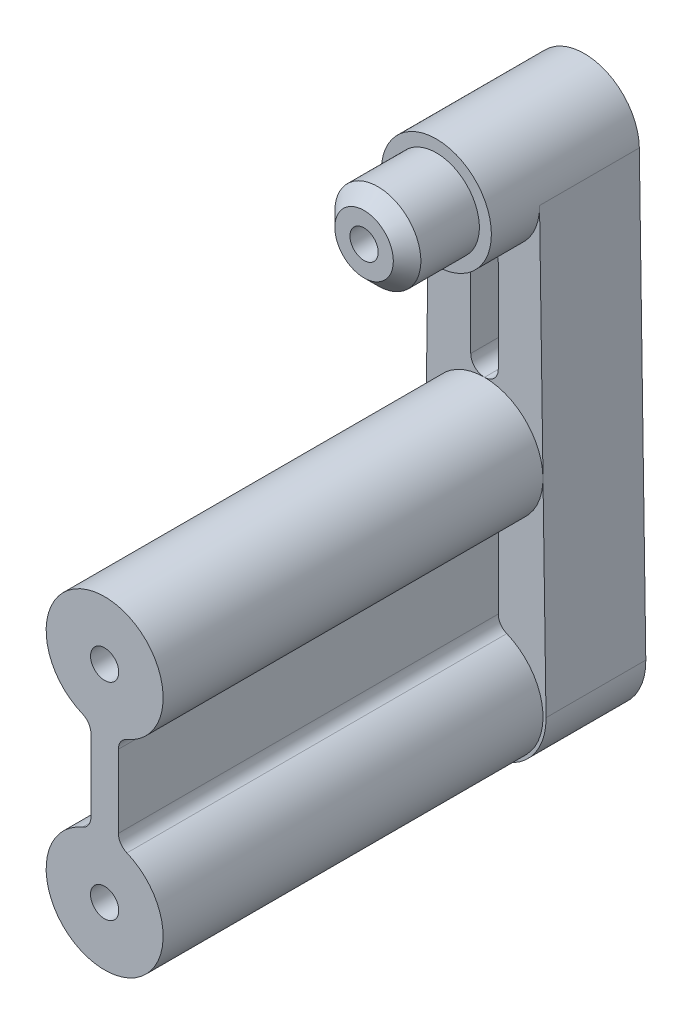
ISO-10303-21;
HEADER;
FILE_DESCRIPTION(('STEP AP214'),'2;1');
FILE_NAME('part.step','',(''),(''),'','','');
FILE_SCHEMA(('AUTOMOTIVE_DESIGN { 1 0 10303 214 1 1 1 1 }'));
ENDSEC;
DATA;
#1=APPLICATION_CONTEXT('core data for automotive mechanical design processes');
#2=APPLICATION_PROTOCOL_DEFINITION('international standard','automotive_design',2000,#1);
#3=PRODUCT_CONTEXT('',#1,'mechanical');
#4=PRODUCT('Part','Part','',(#3));
#5=PRODUCT_RELATED_PRODUCT_CATEGORY('part','',(#4));
#6=PRODUCT_DEFINITION_FORMATION('','',#4);
#7=PRODUCT_DEFINITION_CONTEXT('part definition',#1,'design');
#8=PRODUCT_DEFINITION('design','',#6,#7);
#9=PRODUCT_DEFINITION_SHAPE('','',#8);
#10=(LENGTH_UNIT() NAMED_UNIT(*) SI_UNIT(.MILLI.,.METRE.));
#11=(NAMED_UNIT(*) PLANE_ANGLE_UNIT() SI_UNIT($,.RADIAN.));
#12=(NAMED_UNIT(*) SI_UNIT($,.STERADIAN.) SOLID_ANGLE_UNIT());
#13=UNCERTAINTY_MEASURE_WITH_UNIT(LENGTH_MEASURE(1.E-05),#10,'distance_accuracy_value','');
#14=(GEOMETRIC_REPRESENTATION_CONTEXT(3) GLOBAL_UNCERTAINTY_ASSIGNED_CONTEXT((#13)) GLOBAL_UNIT_ASSIGNED_CONTEXT((#10,
#11,#12)) REPRESENTATION_CONTEXT('',''));
#15=CARTESIAN_POINT('',(0.,0.,0.));
#16=DIRECTION('',(0.,0.,1.));
#17=DIRECTION('',(1.,0.,0.));
#18=AXIS2_PLACEMENT_3D('',#15,#16,#17);
#19=CARTESIAN_POINT('',(0.,15.,34.85));
#20=DIRECTION('',(0.,0.,-1.));
#21=DIRECTION('',(-1.,0.,0.));
#22=AXIS2_PLACEMENT_3D('',#19,#20,#21);
#23=CYLINDRICAL_SURFACE('',#22,4.25);
#24=CARTESIAN_POINT('',(0.,15.,7.25));
#25=DIRECTION('',(0.,0.,1.));
#26=DIRECTION('',(1.,0.,0.));
#27=AXIS2_PLACEMENT_3D('',#24,#25,#26);
#28=CIRCLE('',#27,4.25);
#29=CARTESIAN_POINT('',(0.,19.25,7.25));
#30=VERTEX_POINT('',#29);
#31=CARTESIAN_POINT('',(4.2495404163274,15.0625,7.25));
#32=VERTEX_POINT('',#31);
#33=EDGE_CURVE('E338',#30,#32,#28,.F.);
#34=ORIENTED_EDGE('',*,*,#33,.F.);
#35=CARTESIAN_POINT('',(0.,15.,7.25));
#36=DIRECTION('',(0.,0.,1.));
#37=DIRECTION('',(1.,0.,0.));
#38=AXIS2_PLACEMENT_3D('',#35,#36,#37);
#39=CIRCLE('',#38,4.25);
#40=CARTESIAN_POINT('',(-4.24954041632739,15.0625,7.25));
#41=VERTEX_POINT('',#40);
#42=EDGE_CURVE('E331',#41,#30,#39,.F.);
#43=ORIENTED_EDGE('',*,*,#42,.F.);
#44=CARTESIAN_POINT('',(0.,15.,7.25));
#45=DIRECTION('',(0.,0.,1.));
#46=DIRECTION('',(1.,0.,0.));
#47=AXIS2_PLACEMENT_3D('',#44,#45,#46);
#48=CIRCLE('',#47,4.25);
#49=CARTESIAN_POINT('',(-1.61904761904762,11.0704726992606,7.25));
#50=VERTEX_POINT('',#49);
#51=EDGE_CURVE('E315',#41,#50,#48,.T.);
#52=ORIENTED_EDGE('',*,*,#51,.T.);
#53=DIRECTION('',(0.,0.,-1.));
#54=VECTOR('',#53,1.);
#55=CARTESIAN_POINT('',(-1.61904761904762,11.0704726992606,34.85));
#56=LINE('',#55,#54);
#57=CARTESIAN_POINT('',(-1.61904761904762,11.0704726992606,34.85));
#58=VERTEX_POINT('',#57);
#59=EDGE_CURVE('E395',#50,#58,#56,.F.);
#60=ORIENTED_EDGE('',*,*,#59,.T.);
#61=CARTESIAN_POINT('',(0.,15.,34.85));
#62=DIRECTION('',(0.,0.,1.));
#63=DIRECTION('',(1.,0.,0.));
#64=AXIS2_PLACEMENT_3D('',#61,#62,#63);
#65=CIRCLE('',#64,4.25);
#66=CARTESIAN_POINT('',(1.61904761904762,11.0704726992606,34.85));
#67=VERTEX_POINT('',#66);
#68=EDGE_CURVE('E342',#67,#58,#65,.T.);
#69=ORIENTED_EDGE('',*,*,#68,.F.);
#70=DIRECTION('',(0.,0.,-1.));
#71=VECTOR('',#70,1.);
#72=CARTESIAN_POINT('',(1.61904761904762,11.0704726992606,34.85));
#73=LINE('',#72,#71);
#74=CARTESIAN_POINT('',(1.61904761904762,11.0704726992606,7.25));
#75=VERTEX_POINT('',#74);
#76=EDGE_CURVE('E397',#67,#75,#73,.T.);
#77=ORIENTED_EDGE('',*,*,#76,.T.);
#78=EDGE_CURVE('E323',#75,#32,#48,.T.);
#79=ORIENTED_EDGE('',*,*,#78,.T.);
#80=EDGE_LOOP('',(#34,#43,#52,#60,#69,#77,#79));
#81=FACE_BOUND('',#80,.T.);
#82=ADVANCED_FACE('F167',(#81),#23,.T.);
#83=CARTESIAN_POINT('',(0.,0.,34.85));
#84=DIRECTION('',(0.,0.,-1.));
#85=DIRECTION('',(-1.,0.,0.));
#86=AXIS2_PLACEMENT_3D('',#83,#84,#85);
#87=CYLINDRICAL_SURFACE('',#86,4.25);
#88=CARTESIAN_POINT('',(0.,0.,7.25));
#89=DIRECTION('',(0.,0.,1.));
#90=DIRECTION('',(1.,0.,0.));
#91=AXIS2_PLACEMENT_3D('',#88,#89,#90);
#92=CIRCLE('',#91,4.25);
#93=CARTESIAN_POINT('',(-1.61904761904762,3.92952730073939,7.25));
#94=VERTEX_POINT('',#93);
#95=CARTESIAN_POINT('',(1.61904761904762,3.92952730073939,7.25));
#96=VERTEX_POINT('',#95);
#97=EDGE_CURVE('E544',#94,#96,#92,.T.);
#98=ORIENTED_EDGE('',*,*,#97,.T.);
#99=DIRECTION('',(0.,0.,-1.));
#100=VECTOR('',#99,1.);
#101=CARTESIAN_POINT('',(1.61904761904762,3.92952730073939,34.85));
#102=LINE('',#101,#100);
#103=CARTESIAN_POINT('',(1.61904761904762,3.92952730073939,34.85));
#104=VERTEX_POINT('',#103);
#105=EDGE_CURVE('E415',#96,#104,#102,.F.);
#106=ORIENTED_EDGE('',*,*,#105,.T.);
#107=CARTESIAN_POINT('',(0.,0.,34.85));
#108=DIRECTION('',(0.,0.,1.));
#109=DIRECTION('',(1.,0.,0.));
#110=AXIS2_PLACEMENT_3D('',#107,#108,#109);
#111=CIRCLE('',#110,4.25);
#112=CARTESIAN_POINT('',(-1.61904761904762,3.92952730073939,34.85));
#113=VERTEX_POINT('',#112);
#114=EDGE_CURVE('E339',#113,#104,#111,.T.);
#115=ORIENTED_EDGE('',*,*,#114,.F.);
#116=DIRECTION('',(0.,0.,-1.));
#117=VECTOR('',#116,1.);
#118=CARTESIAN_POINT('',(-1.61904761904762,3.92952730073939,34.85));
#119=LINE('',#118,#117);
#120=EDGE_CURVE('E412',#113,#94,#119,.T.);
#121=ORIENTED_EDGE('',*,*,#120,.T.);
#122=EDGE_LOOP('',(#98,#106,#115,#121));
#123=FACE_BOUND('',#122,.T.);
#124=ADVANCED_FACE('F464',(#123),#87,.T.);
#125=CARTESIAN_POINT('',(0.,0.,5.));
#126=DIRECTION('',(0.,0.,1.));
#127=DIRECTION('',(1.,0.,0.));
#128=AXIS2_PLACEMENT_3D('',#125,#126,#127);
#129=PLANE('',#128);
#130=CARTESIAN_POINT('',(0.,27.,5.));
#131=DIRECTION('',(0.,0.,1.));
#132=DIRECTION('',(1.,0.,0.));
#133=AXIS2_PLACEMENT_3D('',#130,#131,#132);
#134=CIRCLE('',#133,1.);
#135=CARTESIAN_POINT('',(1.,27.,5.));
#136=VERTEX_POINT('',#135);
#137=CARTESIAN_POINT('',(0.,28.,5.));
#138=VERTEX_POINT('',#137);
#139=EDGE_CURVE('E381',#136,#138,#134,.T.);
#140=ORIENTED_EDGE('',*,*,#139,.T.);
#141=CARTESIAN_POINT('',(0.,27.,5.));
#142=DIRECTION('',(0.,0.,1.));
#143=DIRECTION('',(1.,0.,0.));
#144=AXIS2_PLACEMENT_3D('',#141,#142,#143);
#145=CIRCLE('',#144,1.);
#146=CARTESIAN_POINT('',(-1.,27.,5.));
#147=VERTEX_POINT('',#146);
#148=EDGE_CURVE('E383',#138,#147,#145,.T.);
#149=ORIENTED_EDGE('',*,*,#148,.T.);
#150=DIRECTION('',(0.,-1.,0.));
#151=VECTOR('',#150,1.);
#152=CARTESIAN_POINT('',(-1.,0.,5.));
#153=LINE('',#152,#151);
#154=CARTESIAN_POINT('',(-1.,20.25,5.));
#155=VERTEX_POINT('',#154);
#156=EDGE_CURVE('E346',#147,#155,#153,.T.);
#157=ORIENTED_EDGE('',*,*,#156,.T.);
#158=CARTESIAN_POINT('',(0.,20.25,5.));
#159=DIRECTION('',(0.,0.,1.));
#160=DIRECTION('',(1.,0.,0.));
#161=AXIS2_PLACEMENT_3D('',#158,#159,#160);
#162=CIRCLE('',#161,1.);
#163=CARTESIAN_POINT('',(0.,19.25,5.));
#164=VERTEX_POINT('',#163);
#165=EDGE_CURVE('E379',#155,#164,#162,.T.);
#166=ORIENTED_EDGE('',*,*,#165,.T.);
#167=CARTESIAN_POINT('',(0.,20.25,5.));
#168=DIRECTION('',(0.,0.,1.));
#169=DIRECTION('',(1.,0.,0.));
#170=AXIS2_PLACEMENT_3D('',#167,#168,#169);
#171=CIRCLE('',#170,1.);
#172=CARTESIAN_POINT('',(1.,20.25,5.));
#173=VERTEX_POINT('',#172);
#174=EDGE_CURVE('E356',#164,#173,#171,.T.);
#175=ORIENTED_EDGE('',*,*,#174,.T.);
#176=DIRECTION('',(0.,-1.,0.));
#177=VECTOR('',#176,1.);
#178=CARTESIAN_POINT('',(1.,0.,5.));
#179=LINE('',#178,#177);
#180=EDGE_CURVE('E553',#136,#173,#179,.T.);
#181=ORIENTED_EDGE('',*,*,#180,.F.);
#182=EDGE_LOOP('',(#140,#149,#157,#166,#175,#181));
#183=FACE_BOUND('',#182,.T.);
#184=ADVANCED_FACE('F470',(#183),#129,.T.);
#185=CARTESIAN_POINT('',(0.,32.,5.));
#186=DIRECTION('',(0.,0.,-1.));
#187=DIRECTION('',(-1.,0.,0.));
#188=AXIS2_PLACEMENT_3D('',#185,#186,#187);
#189=CYLINDRICAL_SURFACE('',#188,4.);
#190=CARTESIAN_POINT('',(0.,32.,10.75));
#191=DIRECTION('',(0.,0.,1.));
#192=DIRECTION('',(1.,0.,0.));
#193=AXIS2_PLACEMENT_3D('',#190,#191,#192);
#194=CIRCLE('',#193,4.);
#195=CARTESIAN_POINT('',(4.,32.,10.75));
#196=VERTEX_POINT('',#195);
#197=EDGE_CURVE('E352',#196,#196,#194,.T.);
#198=ORIENTED_EDGE('',*,*,#197,.F.);
#199=EDGE_LOOP('',(#198));
#200=FACE_BOUND('',#199,.T.);
#201=CARTESIAN_POINT('',(0.,32.,7.25));
#202=DIRECTION('',(0.,0.,1.));
#203=DIRECTION('',(1.,0.,0.));
#204=AXIS2_PLACEMENT_3D('',#201,#202,#203);
#205=CIRCLE('',#204,4.);
#206=CARTESIAN_POINT('',(0.,28.,7.25));
#207=VERTEX_POINT('',#206);
#208=CARTESIAN_POINT('',(-3.99956745066108,32.0588235294118,7.25));
#209=VERTEX_POINT('',#208);
#210=EDGE_CURVE('E335',#207,#209,#205,.F.);
#211=ORIENTED_EDGE('',*,*,#210,.F.);
#212=CARTESIAN_POINT('',(0.,32.,7.25));
#213=DIRECTION('',(0.,0.,1.));
#214=DIRECTION('',(1.,0.,0.));
#215=AXIS2_PLACEMENT_3D('',#212,#213,#214);
#216=CIRCLE('',#215,4.);
#217=CARTESIAN_POINT('',(3.99956745066108,32.0588235294118,7.25));
#218=VERTEX_POINT('',#217);
#219=EDGE_CURVE('E550',#218,#207,#216,.F.);
#220=ORIENTED_EDGE('',*,*,#219,.F.);
#221=DIRECTION('',(0.,0.,-1.));
#222=VECTOR('',#221,1.);
#223=CARTESIAN_POINT('',(3.99956745066107,32.0588235294118,5.));
#224=LINE('',#223,#222);
#225=CARTESIAN_POINT('',(3.99956745066107,32.0588235294118,0.));
#226=VERTEX_POINT('',#225);
#227=EDGE_CURVE('E367',#218,#226,#224,.T.);
#228=ORIENTED_EDGE('',*,*,#227,.T.);
#229=CARTESIAN_POINT('',(0.,32.,0.));
#230=DIRECTION('',(0.,0.,1.));
#231=DIRECTION('',(1.,0.,0.));
#232=AXIS2_PLACEMENT_3D('',#229,#230,#231);
#233=CIRCLE('',#232,4.);
#234=CARTESIAN_POINT('',(-3.99956745066108,32.0588235294118,0.));
#235=VERTEX_POINT('',#234);
#236=EDGE_CURVE('E371',#226,#235,#233,.T.);
#237=ORIENTED_EDGE('',*,*,#236,.T.);
#238=DIRECTION('',(0.,0.,-1.));
#239=VECTOR('',#238,1.);
#240=CARTESIAN_POINT('',(-3.99956745066108,32.0588235294118,5.));
#241=LINE('',#240,#239);
#242=EDGE_CURVE('E357',#209,#235,#241,.T.);
#243=ORIENTED_EDGE('',*,*,#242,.F.);
#244=EDGE_LOOP('',(#211,#220,#228,#237,#243));
#245=FACE_BOUND('',#244,.T.);
#246=ADVANCED_FACE('F488',(#200,#245),#189,.T.);
#247=CARTESIAN_POINT('',(-4.47010479779768,0.065743944636679,5.));
#248=DIRECTION('',(0.999891862665269,-0.0147058823529413,0.));
#249=DIRECTION('',(0.0147058823529413,0.999891862665269,0.));
#250=AXIS2_PLACEMENT_3D('',#247,#248,#249);
#251=PLANE('',#250);
#252=DIRECTION('',(-0.0147058823529413,-0.999891862665269,0.));
#253=VECTOR('',#252,1.);
#254=CARTESIAN_POINT('',(-4.47010479779768,0.065743944636679,0.));
#255=LINE('',#254,#253);
#256=CARTESIAN_POINT('',(-4.47010479779768,0.065743944636679,0.));
#257=VERTEX_POINT('',#256);
#258=EDGE_CURVE('E361',#235,#257,#255,.T.);
#259=ORIENTED_EDGE('',*,*,#258,.T.);
#260=DIRECTION('',(0.,0.,-1.));
#261=VECTOR('',#260,1.);
#262=CARTESIAN_POINT('',(-4.47010479779768,0.065743944636679,5.));
#263=LINE('',#262,#261);
#264=CARTESIAN_POINT('',(-4.47010479779768,0.065743944636679,7.25));
#265=VERTEX_POINT('',#264);
#266=EDGE_CURVE('E307',#265,#257,#263,.T.);
#267=ORIENTED_EDGE('',*,*,#266,.F.);
#268=DIRECTION('',(-0.0147058823529413,-0.999891862665269,0.));
#269=VECTOR('',#268,1.);
#270=CARTESIAN_POINT('',(-4.47010479779768,0.0657439446366786,7.25));
#271=LINE('',#270,#269);
#272=EDGE_CURVE('E301',#41,#265,#271,.T.);
#273=ORIENTED_EDGE('',*,*,#272,.F.);
#274=DIRECTION('',(-0.0147058823529413,-0.999891862665269,0.));
#275=VECTOR('',#274,1.);
#276=CARTESIAN_POINT('',(-4.47010479779768,0.065743944636679,7.25));
#277=LINE('',#276,#275);
#278=EDGE_CURVE('E305',#209,#41,#277,.T.);
#279=ORIENTED_EDGE('',*,*,#278,.F.);
#280=ORIENTED_EDGE('',*,*,#242,.T.);
#281=EDGE_LOOP('',(#259,#267,#273,#279,#280));
#282=FACE_BOUND('',#281,.T.);
#283=ADVANCED_FACE('F303',(#282),#251,.F.);
#284=CARTESIAN_POINT('',(4.47010479779768,0.0657439446366793,5.));
#285=DIRECTION('',(-0.999891862665269,-0.0147058823529414,0.));
#286=DIRECTION('',(0.0147058823529414,-0.999891862665269,0.));
#287=AXIS2_PLACEMENT_3D('',#284,#285,#286);
#288=PLANE('',#287);
#289=DIRECTION('',(-0.0147058823529414,0.999891862665269,0.));
#290=VECTOR('',#289,1.);
#291=CARTESIAN_POINT('',(4.47010479779768,0.0657439446366793,0.));
#292=LINE('',#291,#290);
#293=CARTESIAN_POINT('',(4.47010479779768,0.0657439446366789,0.));
#294=VERTEX_POINT('',#293);
#295=EDGE_CURVE('E363',#294,#226,#292,.T.);
#296=ORIENTED_EDGE('',*,*,#295,.T.);
#297=ORIENTED_EDGE('',*,*,#227,.F.);
#298=DIRECTION('',(-0.0147058823529414,0.999891862665269,0.));
#299=VECTOR('',#298,1.);
#300=CARTESIAN_POINT('',(4.47010479779768,0.0657439446366793,7.25));
#301=LINE('',#300,#299);
#302=EDGE_CURVE('E349',#32,#218,#301,.T.);
#303=ORIENTED_EDGE('',*,*,#302,.F.);
#304=DIRECTION('',(-0.0147058823529414,0.999891862665269,0.));
#305=VECTOR('',#304,1.);
#306=CARTESIAN_POINT('',(4.47010479779768,0.0657439446366792,7.25));
#307=LINE('',#306,#305);
#308=CARTESIAN_POINT('',(4.47010479779768,0.0657439446366789,7.25));
#309=VERTEX_POINT('',#308);
#310=EDGE_CURVE('E593',#309,#32,#307,.T.);
#311=ORIENTED_EDGE('',*,*,#310,.F.);
#312=DIRECTION('',(0.,0.,-1.));
#313=VECTOR('',#312,1.);
#314=CARTESIAN_POINT('',(4.47010479779768,0.0657439446366789,5.));
#315=LINE('',#314,#313);
#316=EDGE_CURVE('E364',#309,#294,#315,.T.);
#317=ORIENTED_EDGE('',*,*,#316,.T.);
#318=EDGE_LOOP('',(#296,#297,#303,#311,#317));
#319=FACE_BOUND('',#318,.T.);
#320=ADVANCED_FACE('F493',(#319),#288,.F.);
#321=CARTESIAN_POINT('',(0.,0.,0.));
#322=DIRECTION('',(0.,0.,1.));
#323=DIRECTION('',(1.,0.,0.));
#324=AXIS2_PLACEMENT_3D('',#321,#322,#323);
#325=PLANE('',#324);
#326=CARTESIAN_POINT('',(0.,15.,0.));
#327=DIRECTION('',(0.,0.,1.));
#328=DIRECTION('',(1.,0.,0.));
#329=AXIS2_PLACEMENT_3D('',#326,#327,#328);
#330=CIRCLE('',#329,1.02499999999999);
#331=CARTESIAN_POINT('',(1.025,15.,0.));
#332=VERTEX_POINT('',#331);
#333=EDGE_CURVE('E618',#332,#332,#330,.T.);
#334=ORIENTED_EDGE('',*,*,#333,.T.);
#335=EDGE_LOOP('',(#334));
#336=FACE_BOUND('',#335,.T.);
#337=CARTESIAN_POINT('',(0.,0.,0.));
#338=DIRECTION('',(0.,0.,1.));
#339=DIRECTION('',(1.,0.,0.));
#340=AXIS2_PLACEMENT_3D('',#337,#338,#339);
#341=CIRCLE('',#340,1.02499999999999);
#342=CARTESIAN_POINT('',(1.02499999999999,0.,0.));
#343=VERTEX_POINT('',#342);
#344=EDGE_CURVE('E612',#343,#343,#341,.T.);
#345=ORIENTED_EDGE('',*,*,#344,.T.);
#346=EDGE_LOOP('',(#345));
#347=FACE_BOUND('',#346,.T.);
#348=CARTESIAN_POINT('',(0.,32.,0.));
#349=DIRECTION('',(0.,0.,1.));
#350=DIRECTION('',(1.,0.,0.));
#351=AXIS2_PLACEMENT_3D('',#348,#349,#350);
#352=CIRCLE('',#351,1.02499999999999);
#353=CARTESIAN_POINT('',(1.02499999999999,32.,0.));
#354=VERTEX_POINT('',#353);
#355=EDGE_CURVE('E445',#354,#354,#352,.T.);
#356=ORIENTED_EDGE('',*,*,#355,.T.);
#357=EDGE_LOOP('',(#356));
#358=FACE_BOUND('',#357,.T.);
#359=ORIENTED_EDGE('',*,*,#258,.F.);
#360=ORIENTED_EDGE('',*,*,#236,.F.);
#361=ORIENTED_EDGE('',*,*,#295,.F.);
#362=CARTESIAN_POINT('',(0.,0.,0.));
#363=DIRECTION('',(0.,0.,1.));
#364=DIRECTION('',(1.,0.,0.));
#365=AXIS2_PLACEMENT_3D('',#362,#363,#364);
#366=CIRCLE('',#365,4.47058823529412);
#367=EDGE_CURVE('E360',#257,#294,#366,.T.);
#368=ORIENTED_EDGE('',*,*,#367,.F.);
#369=EDGE_LOOP('',(#359,#360,#361,#368));
#370=FACE_BOUND('',#369,.T.);
#371=ADVANCED_FACE('F490',(#336,#347,#358,#370),#325,.F.);
#372=CARTESIAN_POINT('',(0.,0.,5.));
#373=DIRECTION('',(0.,0.,-1.));
#374=DIRECTION('',(-1.,0.,0.));
#375=AXIS2_PLACEMENT_3D('',#372,#373,#374);
#376=CYLINDRICAL_SURFACE('',#375,4.47058823529412);
#377=ORIENTED_EDGE('',*,*,#367,.T.);
#378=ORIENTED_EDGE('',*,*,#316,.F.);
#379=CARTESIAN_POINT('',(0.,0.,7.25));
#380=DIRECTION('',(0.,0.,1.));
#381=DIRECTION('',(1.,0.,0.));
#382=AXIS2_PLACEMENT_3D('',#379,#380,#381);
#383=CIRCLE('',#382,4.47058823529412);
#384=EDGE_CURVE('E311',#265,#309,#383,.T.);
#385=ORIENTED_EDGE('',*,*,#384,.F.);
#386=ORIENTED_EDGE('',*,*,#266,.T.);
#387=EDGE_LOOP('',(#377,#378,#385,#386));
#388=FACE_BOUND('',#387,.T.);
#389=ADVANCED_FACE('F484',(#388),#376,.T.);
#390=CARTESIAN_POINT('',(0.,32.,10.75));
#391=DIRECTION('',(0.,0.,1.));
#392=DIRECTION('',(1.,0.,0.));
#393=AXIS2_PLACEMENT_3D('',#390,#391,#392);
#394=PLANE('',#393);
#395=CARTESIAN_POINT('',(0.,32.,10.75));
#396=DIRECTION('',(0.,0.,1.));
#397=DIRECTION('',(1.,0.,0.));
#398=AXIS2_PLACEMENT_3D('',#395,#396,#397);
#399=CIRCLE('',#398,3.125);
#400=CARTESIAN_POINT('',(-3.125,32.,10.75));
#401=VERTEX_POINT('',#400);
#402=EDGE_CURVE('E353',#401,#401,#399,.T.);
#403=ORIENTED_EDGE('',*,*,#402,.F.);
#404=EDGE_LOOP('',(#403));
#405=FACE_BOUND('',#404,.T.);
#406=ORIENTED_EDGE('',*,*,#197,.T.);
#407=EDGE_LOOP('',(#406));
#408=FACE_BOUND('',#407,.T.);
#409=ADVANCED_FACE('F480',(#405,#408),#394,.T.);
#410=CARTESIAN_POINT('',(0.,32.,16.));
#411=DIRECTION('',(0.,0.,-1.));
#412=DIRECTION('',(-1.,0.,0.));
#413=AXIS2_PLACEMENT_3D('',#410,#411,#412);
#414=CYLINDRICAL_SURFACE('',#413,3.125);
#415=CARTESIAN_POINT('',(0.,32.,15.));
#416=DIRECTION('',(0.,0.,1.));
#417=DIRECTION('',(1.,0.,0.));
#418=AXIS2_PLACEMENT_3D('',#415,#416,#417);
#419=CIRCLE('',#418,3.125);
#420=CARTESIAN_POINT('',(-3.125,32.,15.));
#421=VERTEX_POINT('',#420);
#422=EDGE_CURVE('E12',#421,#421,#419,.F.);
#423=CARTESIAN_POINT('',(-3.125,32.,15.));
#424=CARTESIAN_POINT('',(-3.125,32.,14.9557291666667));
#425=CARTESIAN_POINT('',(-3.125,32.,14.9114583333334));
#426=CARTESIAN_POINT('',(-3.125,32.,14.8229166666667));
#427=CARTESIAN_POINT('',(-3.125,32.,14.7786458333334));
#428=CARTESIAN_POINT('',(-3.125,32.,14.6901041666667));
#429=CARTESIAN_POINT('',(-3.125,32.,14.6458333333334));
#430=CARTESIAN_POINT('',(-3.125,32.,14.5572916666667));
#431=CARTESIAN_POINT('',(-3.125,32.,14.5130208333334));
#432=CARTESIAN_POINT('',(-3.125,32.,14.4244791666667));
#433=CARTESIAN_POINT('',(-3.125,32.,14.3802083333334));
#434=CARTESIAN_POINT('',(-3.125,32.,14.2916666666667));
#435=CARTESIAN_POINT('',(-3.125,32.,14.2473958333334));
#436=CARTESIAN_POINT('',(-3.125,32.,14.1588541666667));
#437=CARTESIAN_POINT('',(-3.125,32.,14.1145833333333));
#438=CARTESIAN_POINT('',(-3.125,32.,14.0260416666667));
#439=CARTESIAN_POINT('',(-3.125,32.,13.9817708333333));
#440=CARTESIAN_POINT('',(-3.125,32.,13.8932291666667));
#441=CARTESIAN_POINT('',(-3.125,32.,13.8489583333333));
#442=CARTESIAN_POINT('',(-3.125,32.,13.7604166666667));
#443=CARTESIAN_POINT('',(-3.125,32.,13.7161458333333));
#444=CARTESIAN_POINT('',(-3.125,32.,13.6276041666667));
#445=CARTESIAN_POINT('',(-3.125,32.,13.5833333333333));
#446=CARTESIAN_POINT('',(-3.125,32.,13.4947916666667));
#447=CARTESIAN_POINT('',(-3.125,32.,13.4505208333333));
#448=CARTESIAN_POINT('',(-3.125,32.,13.3619791666667));
#449=CARTESIAN_POINT('',(-3.125,32.,13.3177083333333));
#450=CARTESIAN_POINT('',(-3.125,32.,13.2291666666667));
#451=CARTESIAN_POINT('',(-3.125,32.,13.1848958333333));
#452=CARTESIAN_POINT('',(-3.125,32.,13.0963541666667));
#453=CARTESIAN_POINT('',(-3.125,32.,13.0520833333333));
#454=CARTESIAN_POINT('',(-3.125,32.,12.9635416666667));
#455=CARTESIAN_POINT('',(-3.125,32.,12.9192708333333));
#456=CARTESIAN_POINT('',(-3.125,32.,12.8307291666667));
#457=CARTESIAN_POINT('',(-3.125,32.,12.7864583333333));
#458=CARTESIAN_POINT('',(-3.125,32.,12.6979166666667));
#459=CARTESIAN_POINT('',(-3.125,32.,12.6536458333333));
#460=CARTESIAN_POINT('',(-3.125,32.,12.5651041666667));
#461=CARTESIAN_POINT('',(-3.125,32.,12.5208333333333));
#462=CARTESIAN_POINT('',(-3.125,32.,12.4322916666667));
#463=CARTESIAN_POINT('',(-3.125,32.,12.3880208333333));
#464=CARTESIAN_POINT('',(-3.125,32.,12.2994791666667));
#465=CARTESIAN_POINT('',(-3.125,32.,12.2552083333333));
#466=CARTESIAN_POINT('',(-3.125,32.,12.1666666666667));
#467=CARTESIAN_POINT('',(-3.125,32.,12.1223958333333));
#468=CARTESIAN_POINT('',(-3.125,32.,12.0338541666667));
#469=CARTESIAN_POINT('',(-3.125,32.,11.9895833333333));
#470=CARTESIAN_POINT('',(-3.125,32.,11.9010416666667));
#471=CARTESIAN_POINT('',(-3.125,32.,11.8567708333333));
#472=CARTESIAN_POINT('',(-3.125,32.,11.7682291666667));
#473=CARTESIAN_POINT('',(-3.125,32.,11.7239583333333));
#474=CARTESIAN_POINT('',(-3.125,32.,11.6354166666667));
#475=CARTESIAN_POINT('',(-3.125,32.,11.5911458333333));
#476=CARTESIAN_POINT('',(-3.125,32.,11.5026041666667));
#477=CARTESIAN_POINT('',(-3.125,32.,11.4583333333333));
#478=CARTESIAN_POINT('',(-3.125,32.,11.3697916666667));
#479=CARTESIAN_POINT('',(-3.125,32.,11.3255208333333));
#480=CARTESIAN_POINT('',(-3.125,32.,11.2369791666667));
#481=CARTESIAN_POINT('',(-3.125,32.,11.1927083333333));
#482=CARTESIAN_POINT('',(-3.125,32.,11.1041666666667));
#483=CARTESIAN_POINT('',(-3.125,32.,11.0598958333333));
#484=CARTESIAN_POINT('',(-3.125,32.,10.9713541666667));
#485=CARTESIAN_POINT('',(-3.125,32.,10.9270833333333));
#486=CARTESIAN_POINT('',(-3.125,32.,10.8385416666667));
#487=CARTESIAN_POINT('',(-3.125,32.,10.7942708333333));
#488=CARTESIAN_POINT('',(-3.125,32.,10.75));
#489=B_SPLINE_CURVE_WITH_KNOTS('',3,(#423,#424,#425,#426,#427,#428,#429,#430,#431,#432,#433,
#434,#435,#436,#437,#438,#439,#440,#441,#442,#443,#444,#445,#446,#447,#448,#449,#450,#451,#452,
#453,#454,#455,#456,#457,#458,#459,#460,#461,#462,#463,#464,#465,#466,#467,#468,#469,#470,#471,
#472,#473,#474,#475,#476,#477,#478,#479,#480,#481,#482,#483,#484,#485,#486,#487,#488),
.UNSPECIFIED.,.F.,.F.,(4,2,2,2,2,2,2,2,2,2,2,2,2,2,2,2,2,2,2,2,2,2,2,2,2,2,2,2,2,2,2,2,4),(0.,
0.132812500000001,0.265625,0.398437500000001,0.531250000000002,0.664062500000003,
0.796875000000004,0.929687500000005,1.06250000000001,1.19531250000001,1.32812500000001,
1.46093750000001,1.59375000000001,1.72656250000001,1.85937500000001,1.99218750000001,
2.12500000000001,2.25781250000001,2.39062500000001,2.52343750000001,2.65625000000001,
2.78906250000002,2.92187500000002,3.05468750000002,3.18750000000002,3.32031250000002,
3.45312500000002,3.58593750000002,3.71875000000002,3.85156250000002,3.98437500000002,
4.11718750000002,4.25000000000002),.UNSPECIFIED.);
#490=EDGE_CURVE('BSEAM477',#421,#401,#489,.T.);
#491=ORIENTED_EDGE('',*,*,#422,.T.);
#492=ORIENTED_EDGE('',*,*,#402,.T.);
#493=ORIENTED_EDGE('',*,*,#490,.T.);
#494=ORIENTED_EDGE('',*,*,#490,.F.);
#495=EDGE_LOOP('',(#491,#493,#492,#494));
#496=FACE_BOUND('',#495,.T.);
#497=ADVANCED_FACE('F477',(#496),#414,.T.);
#498=CARTESIAN_POINT('',(0.,32.,16.));
#499=DIRECTION('',(0.,0.,1.));
#500=DIRECTION('',(1.,0.,0.));
#501=AXIS2_PLACEMENT_3D('',#498,#499,#500);
#502=PLANE('',#501);
#503=CARTESIAN_POINT('',(0.,32.,16.));
#504=DIRECTION('',(0.,0.,1.));
#505=DIRECTION('',(1.,0.,0.));
#506=AXIS2_PLACEMENT_3D('',#503,#504,#505);
#507=CIRCLE('',#506,2.12500000000003);
#508=CARTESIAN_POINT('',(2.12500000000003,32.,16.));
#509=VERTEX_POINT('',#508);
#510=EDGE_CURVE('E176',#509,#509,#507,.T.);
#511=ORIENTED_EDGE('',*,*,#510,.T.);
#512=EDGE_LOOP('',(#511));
#513=FACE_BOUND('',#512,.T.);
#514=CARTESIAN_POINT('',(0.,32.,16.));
#515=DIRECTION('',(0.,0.,1.));
#516=DIRECTION('',(1.,0.,0.));
#517=AXIS2_PLACEMENT_3D('',#514,#515,#516);
#518=CIRCLE('',#517,1.025);
#519=CARTESIAN_POINT('',(1.025,32.,16.));
#520=VERTEX_POINT('',#519);
#521=EDGE_CURVE('E443',#520,#520,#518,.T.);
#522=ORIENTED_EDGE('',*,*,#521,.F.);
#523=EDGE_LOOP('',(#522));
#524=FACE_BOUND('',#523,.T.);
#525=ADVANCED_FACE('F449',(#513,#524),#502,.T.);
#526=CARTESIAN_POINT('',(0.,15.,34.85));
#527=DIRECTION('',(0.,0.,1.));
#528=DIRECTION('',(1.,0.,0.));
#529=AXIS2_PLACEMENT_3D('',#526,#527,#528);
#530=PLANE('',#529);
#531=CARTESIAN_POINT('',(0.,15.,34.85));
#532=DIRECTION('',(0.,0.,1.));
#533=DIRECTION('',(1.,0.,0.));
#534=AXIS2_PLACEMENT_3D('',#531,#532,#533);
#535=CIRCLE('',#534,1.025);
#536=CARTESIAN_POINT('',(1.025,15.,34.85));
#537=VERTEX_POINT('',#536);
#538=EDGE_CURVE('E621',#537,#537,#535,.T.);
#539=ORIENTED_EDGE('',*,*,#538,.F.);
#540=EDGE_LOOP('',(#539));
#541=FACE_BOUND('',#540,.T.);
#542=CARTESIAN_POINT('',(0.,0.,34.85));
#543=DIRECTION('',(0.,0.,1.));
#544=DIRECTION('',(1.,0.,0.));
#545=AXIS2_PLACEMENT_3D('',#542,#543,#544);
#546=CIRCLE('',#545,1.025);
#547=CARTESIAN_POINT('',(1.025,0.,34.85));
#548=VERTEX_POINT('',#547);
#549=EDGE_CURVE('E615',#548,#548,#546,.T.);
#550=ORIENTED_EDGE('',*,*,#549,.F.);
#551=EDGE_LOOP('',(#550));
#552=FACE_BOUND('',#551,.T.);
#553=DIRECTION('',(0.,-1.,0.));
#554=VECTOR('',#553,1.);
#555=CARTESIAN_POINT('',(1.,0.,34.85));
#556=LINE('',#555,#554);
#557=CARTESIAN_POINT('',(1.,10.1458780402631,34.85));
#558=VERTEX_POINT('',#557);
#559=CARTESIAN_POINT('',(1.,4.8541219597369,34.85));
#560=VERTEX_POINT('',#559);
#561=EDGE_CURVE('E324',#558,#560,#556,.T.);
#562=ORIENTED_EDGE('',*,*,#561,.F.);
#563=CARTESIAN_POINT('',(2.,10.1458780402631,34.85));
#564=DIRECTION('',(0.,0.,1.));
#565=DIRECTION('',(1.,0.,0.));
#566=AXIS2_PLACEMENT_3D('',#563,#564,#565);
#567=CIRCLE('',#566,1.);
#568=EDGE_CURVE('E431',#558,#67,#567,.F.);
#569=ORIENTED_EDGE('',*,*,#568,.T.);
#570=ORIENTED_EDGE('',*,*,#68,.T.);
#571=CARTESIAN_POINT('',(-2.,10.1458780402631,34.85));
#572=DIRECTION('',(0.,0.,1.));
#573=DIRECTION('',(1.,0.,0.));
#574=AXIS2_PLACEMENT_3D('',#571,#572,#573);
#575=CIRCLE('',#574,1.);
#576=CARTESIAN_POINT('',(-1.,10.1458780402631,34.85));
#577=VERTEX_POINT('',#576);
#578=EDGE_CURVE('E190',#58,#577,#575,.F.);
#579=ORIENTED_EDGE('',*,*,#578,.T.);
#580=DIRECTION('',(0.,-1.,0.));
#581=VECTOR('',#580,1.);
#582=CARTESIAN_POINT('',(-1.,0.,34.85));
#583=LINE('',#582,#581);
#584=CARTESIAN_POINT('',(-1.,4.8541219597369,34.85));
#585=VERTEX_POINT('',#584);
#586=EDGE_CURVE('E439',#577,#585,#583,.T.);
#587=ORIENTED_EDGE('',*,*,#586,.T.);
#588=CARTESIAN_POINT('',(-2.,4.8541219597369,34.85));
#589=DIRECTION('',(0.,0.,1.));
#590=DIRECTION('',(1.,0.,0.));
#591=AXIS2_PLACEMENT_3D('',#588,#589,#590);
#592=CIRCLE('',#591,1.);
#593=EDGE_CURVE('E433',#585,#113,#592,.F.);
#594=ORIENTED_EDGE('',*,*,#593,.T.);
#595=ORIENTED_EDGE('',*,*,#114,.T.);
#596=CARTESIAN_POINT('',(2.,4.8541219597369,34.85));
#597=DIRECTION('',(0.,0.,1.));
#598=DIRECTION('',(1.,0.,0.));
#599=AXIS2_PLACEMENT_3D('',#596,#597,#598);
#600=CIRCLE('',#599,1.);
#601=EDGE_CURVE('E429',#104,#560,#600,.F.);
#602=ORIENTED_EDGE('',*,*,#601,.T.);
#603=EDGE_LOOP('',(#562,#569,#570,#579,#587,#594,#595,#602));
#604=FACE_BOUND('',#603,.T.);
#605=ADVANCED_FACE('F475',(#541,#552,#604),#530,.T.);
#606=CARTESIAN_POINT('',(-1.,0.,7.25));
#607=DIRECTION('',(1.,0.,0.));
#608=DIRECTION('',(0.,1.,0.));
#609=AXIS2_PLACEMENT_3D('',#606,#607,#608);
#610=PLANE('',#609);
#611=ORIENTED_EDGE('',*,*,#156,.F.);
#612=DIRECTION('',(0.,0.,-1.));
#613=VECTOR('',#612,1.);
#614=CARTESIAN_POINT('',(-1.,27.,7.25));
#615=LINE('',#614,#613);
#616=CARTESIAN_POINT('',(-1.,27.,7.25));
#617=VERTEX_POINT('',#616);
#618=EDGE_CURVE('E388',#147,#617,#615,.F.);
#619=ORIENTED_EDGE('',*,*,#618,.T.);
#620=DIRECTION('',(0.,-1.,0.));
#621=VECTOR('',#620,1.);
#622=CARTESIAN_POINT('',(-1.,0.,7.25));
#623=LINE('',#622,#621);
#624=CARTESIAN_POINT('',(-1.,20.25,7.25));
#625=VERTEX_POINT('',#624);
#626=EDGE_CURVE('E348',#617,#625,#623,.T.);
#627=ORIENTED_EDGE('',*,*,#626,.T.);
#628=DIRECTION('',(0.,0.,-1.));
#629=VECTOR('',#628,1.);
#630=CARTESIAN_POINT('',(-1.,20.25,7.25));
#631=LINE('',#630,#629);
#632=EDGE_CURVE('E385',#625,#155,#631,.T.);
#633=ORIENTED_EDGE('',*,*,#632,.T.);
#634=EDGE_LOOP('',(#611,#619,#627,#633));
#635=FACE_BOUND('',#634,.T.);
#636=ADVANCED_FACE('F566',(#635),#610,.T.);
#637=CARTESIAN_POINT('',(0.,0.,7.25));
#638=DIRECTION('',(0.,0.,1.));
#639=DIRECTION('',(1.,0.,0.));
#640=AXIS2_PLACEMENT_3D('',#637,#638,#639);
#641=PLANE('',#640);
#642=ORIENTED_EDGE('',*,*,#626,.F.);
#643=CARTESIAN_POINT('',(0.,27.,7.25));
#644=DIRECTION('',(0.,0.,1.));
#645=DIRECTION('',(1.,0.,0.));
#646=AXIS2_PLACEMENT_3D('',#643,#644,#645);
#647=CIRCLE('',#646,1.);
#648=EDGE_CURVE('E421',#617,#207,#647,.F.);
#649=ORIENTED_EDGE('',*,*,#648,.T.);
#650=ORIENTED_EDGE('',*,*,#210,.T.);
#651=ORIENTED_EDGE('',*,*,#278,.T.);
#652=ORIENTED_EDGE('',*,*,#42,.T.);
#653=CARTESIAN_POINT('',(0.,20.25,7.25));
#654=DIRECTION('',(0.,0.,1.));
#655=DIRECTION('',(1.,0.,0.));
#656=AXIS2_PLACEMENT_3D('',#653,#654,#655);
#657=CIRCLE('',#656,1.);
#658=EDGE_CURVE('E425',#30,#625,#657,.F.);
#659=ORIENTED_EDGE('',*,*,#658,.T.);
#660=EDGE_LOOP('',(#642,#649,#650,#651,#652,#659));
#661=FACE_BOUND('',#660,.T.);
#662=ADVANCED_FACE('F330',(#661),#641,.T.);
#663=CARTESIAN_POINT('',(1.,0.,7.25));
#664=DIRECTION('',(1.,0.,0.));
#665=DIRECTION('',(0.,1.,0.));
#666=AXIS2_PLACEMENT_3D('',#663,#664,#665);
#667=PLANE('',#666);
#668=DIRECTION('',(0.,-1.,0.));
#669=VECTOR('',#668,1.);
#670=CARTESIAN_POINT('',(1.,0.,7.25));
#671=LINE('',#670,#669);
#672=CARTESIAN_POINT('',(1.,27.,7.25));
#673=VERTEX_POINT('',#672);
#674=CARTESIAN_POINT('',(1.,20.25,7.25));
#675=VERTEX_POINT('',#674);
#676=EDGE_CURVE('E552',#673,#675,#671,.T.);
#677=ORIENTED_EDGE('',*,*,#676,.F.);
#678=DIRECTION('',(0.,0.,1.));
#679=VECTOR('',#678,1.);
#680=CARTESIAN_POINT('',(1.,27.,5.));
#681=LINE('',#680,#679);
#682=EDGE_CURVE('E393',#673,#136,#681,.F.);
#683=ORIENTED_EDGE('',*,*,#682,.T.);
#684=ORIENTED_EDGE('',*,*,#180,.T.);
#685=DIRECTION('',(0.,0.,1.));
#686=VECTOR('',#685,1.);
#687=CARTESIAN_POINT('',(1.,20.25,7.25));
#688=LINE('',#687,#686);
#689=EDGE_CURVE('E391',#173,#675,#688,.T.);
#690=ORIENTED_EDGE('',*,*,#689,.T.);
#691=EDGE_LOOP('',(#677,#683,#684,#690));
#692=FACE_BOUND('',#691,.T.);
#693=ADVANCED_FACE('F576',(#692),#667,.F.);
#694=CARTESIAN_POINT('',(0.,0.,7.25));
#695=DIRECTION('',(0.,0.,1.));
#696=DIRECTION('',(1.,0.,0.));
#697=AXIS2_PLACEMENT_3D('',#694,#695,#696);
#698=PLANE('',#697);
#699=ORIENTED_EDGE('',*,*,#219,.T.);
#700=CARTESIAN_POINT('',(0.,27.,7.25));
#701=DIRECTION('',(0.,0.,1.));
#702=DIRECTION('',(1.,0.,0.));
#703=AXIS2_PLACEMENT_3D('',#700,#701,#702);
#704=CIRCLE('',#703,1.);
#705=EDGE_CURVE('E423',#207,#673,#704,.F.);
#706=ORIENTED_EDGE('',*,*,#705,.T.);
#707=ORIENTED_EDGE('',*,*,#676,.T.);
#708=CARTESIAN_POINT('',(0.,20.25,7.25));
#709=DIRECTION('',(0.,0.,1.));
#710=DIRECTION('',(1.,0.,0.));
#711=AXIS2_PLACEMENT_3D('',#708,#709,#710);
#712=CIRCLE('',#711,1.);
#713=EDGE_CURVE('E427',#675,#30,#712,.F.);
#714=ORIENTED_EDGE('',*,*,#713,.T.);
#715=ORIENTED_EDGE('',*,*,#33,.T.);
#716=ORIENTED_EDGE('',*,*,#302,.T.);
#717=EDGE_LOOP('',(#699,#706,#707,#714,#715,#716));
#718=FACE_BOUND('',#717,.T.);
#719=ADVANCED_FACE('F579',(#718),#698,.T.);
#720=CARTESIAN_POINT('',(0.,0.,7.25));
#721=DIRECTION('',(0.,0.,1.));
#722=DIRECTION('',(1.,0.,0.));
#723=AXIS2_PLACEMENT_3D('',#720,#721,#722);
#724=PLANE('',#723);
#725=DIRECTION('',(0.,-1.,0.));
#726=VECTOR('',#725,1.);
#727=CARTESIAN_POINT('',(1.,0.,7.25));
#728=LINE('',#727,#726);
#729=CARTESIAN_POINT('',(1.,10.1458780402631,7.25));
#730=VERTEX_POINT('',#729);
#731=CARTESIAN_POINT('',(1.,4.8541219597369,7.25));
#732=VERTEX_POINT('',#731);
#733=EDGE_CURVE('E561',#730,#732,#728,.T.);
#734=ORIENTED_EDGE('',*,*,#733,.T.);
#735=CARTESIAN_POINT('',(2.,4.8541219597369,7.25));
#736=DIRECTION('',(0.,0.,1.));
#737=DIRECTION('',(1.,0.,0.));
#738=AXIS2_PLACEMENT_3D('',#735,#736,#737);
#739=CIRCLE('',#738,1.);
#740=EDGE_CURVE('E410',#732,#96,#739,.T.);
#741=ORIENTED_EDGE('',*,*,#740,.T.);
#742=ORIENTED_EDGE('',*,*,#97,.F.);
#743=CARTESIAN_POINT('',(-2.,4.8541219597369,7.25));
#744=DIRECTION('',(0.,0.,1.));
#745=DIRECTION('',(1.,0.,0.));
#746=AXIS2_PLACEMENT_3D('',#743,#744,#745);
#747=CIRCLE('',#746,1.);
#748=CARTESIAN_POINT('',(-1.,4.8541219597369,7.25));
#749=VERTEX_POINT('',#748);
#750=EDGE_CURVE('E406',#94,#749,#747,.T.);
#751=ORIENTED_EDGE('',*,*,#750,.T.);
#752=DIRECTION('',(0.,-1.,0.));
#753=VECTOR('',#752,1.);
#754=CARTESIAN_POINT('',(-1.,0.,7.25));
#755=LINE('',#754,#753);
#756=CARTESIAN_POINT('',(-1.,10.1458780402631,7.25));
#757=VERTEX_POINT('',#756);
#758=EDGE_CURVE('E312',#757,#749,#755,.T.);
#759=ORIENTED_EDGE('',*,*,#758,.F.);
#760=CARTESIAN_POINT('',(-2.,10.1458780402631,7.25));
#761=DIRECTION('',(0.,0.,1.));
#762=DIRECTION('',(1.,0.,0.));
#763=AXIS2_PLACEMENT_3D('',#760,#761,#762);
#764=CIRCLE('',#763,1.);
#765=EDGE_CURVE('E319',#757,#50,#764,.T.);
#766=ORIENTED_EDGE('',*,*,#765,.T.);
#767=ORIENTED_EDGE('',*,*,#51,.F.);
#768=ORIENTED_EDGE('',*,*,#272,.T.);
#769=ORIENTED_EDGE('',*,*,#384,.T.);
#770=ORIENTED_EDGE('',*,*,#310,.T.);
#771=ORIENTED_EDGE('',*,*,#78,.F.);
#772=CARTESIAN_POINT('',(2.,10.1458780402631,7.25));
#773=DIRECTION('',(0.,0.,1.));
#774=DIRECTION('',(1.,0.,0.));
#775=AXIS2_PLACEMENT_3D('',#772,#773,#774);
#776=CIRCLE('',#775,1.);
#777=EDGE_CURVE('E408',#75,#730,#776,.T.);
#778=ORIENTED_EDGE('',*,*,#777,.T.);
#779=EDGE_LOOP('',(#734,#741,#742,#751,#759,#766,#767,#768,#769,#770,#771,#778));
#780=FACE_BOUND('',#779,.T.);
#781=ADVANCED_FACE('F317',(#780),#724,.T.);
#782=CARTESIAN_POINT('',(1.,0.,41.8791767207921));
#783=DIRECTION('',(1.,0.,0.));
#784=DIRECTION('',(0.,1.,0.));
#785=AXIS2_PLACEMENT_3D('',#782,#783,#784);
#786=PLANE('',#785);
#787=ORIENTED_EDGE('',*,*,#561,.T.);
#788=DIRECTION('',(0.,0.,-1.));
#789=VECTOR('',#788,1.);
#790=CARTESIAN_POINT('',(1.,4.8541219597369,41.8791767207921));
#791=LINE('',#790,#789);
#792=EDGE_CURVE('E402',#560,#732,#791,.T.);
#793=ORIENTED_EDGE('',*,*,#792,.T.);
#794=ORIENTED_EDGE('',*,*,#733,.F.);
#795=DIRECTION('',(0.,0.,-1.));
#796=VECTOR('',#795,1.);
#797=CARTESIAN_POINT('',(1.,10.1458780402631,41.8791767207921));
#798=LINE('',#797,#796);
#799=EDGE_CURVE('E400',#730,#558,#798,.F.);
#800=ORIENTED_EDGE('',*,*,#799,.T.);
#801=EDGE_LOOP('',(#787,#793,#794,#800));
#802=FACE_BOUND('',#801,.T.);
#803=ADVANCED_FACE('F601',(#802),#786,.T.);
#804=CARTESIAN_POINT('',(-1.,0.,41.8791767207921));
#805=DIRECTION('',(1.,0.,0.));
#806=DIRECTION('',(0.,1.,0.));
#807=AXIS2_PLACEMENT_3D('',#804,#805,#806);
#808=PLANE('',#807);
#809=ORIENTED_EDGE('',*,*,#758,.T.);
#810=DIRECTION('',(0.,0.,1.));
#811=VECTOR('',#810,1.);
#812=CARTESIAN_POINT('',(-1.,4.8541219597369,34.85));
#813=LINE('',#812,#811);
#814=EDGE_CURVE('E183',#749,#585,#813,.T.);
#815=ORIENTED_EDGE('',*,*,#814,.T.);
#816=ORIENTED_EDGE('',*,*,#586,.F.);
#817=DIRECTION('',(0.,0.,1.));
#818=VECTOR('',#817,1.);
#819=CARTESIAN_POINT('',(-1.,10.1458780402631,7.25));
#820=LINE('',#819,#818);
#821=EDGE_CURVE('E417',#577,#757,#820,.F.);
#822=ORIENTED_EDGE('',*,*,#821,.T.);
#823=EDGE_LOOP('',(#809,#815,#816,#822));
#824=FACE_BOUND('',#823,.T.);
#825=ADVANCED_FACE('F513',(#824),#808,.F.);
#826=CARTESIAN_POINT('',(0.,27.,5.));
#827=DIRECTION('',(0.,0.,-1.));
#828=DIRECTION('',(-1.,0.,0.));
#829=AXIS2_PLACEMENT_3D('',#826,#827,#828);
#830=CYLINDRICAL_SURFACE('',#829,1.);
#831=ORIENTED_EDGE('',*,*,#682,.F.);
#832=ORIENTED_EDGE('',*,*,#705,.F.);
#833=DIRECTION('',(0.,0.,-1.));
#834=VECTOR('',#833,1.);
#835=CARTESIAN_POINT('',(0.,28.,5.));
#836=LINE('',#835,#834);
#837=EDGE_CURVE('E436',#138,#207,#836,.F.);
#838=ORIENTED_EDGE('',*,*,#837,.F.);
#839=ORIENTED_EDGE('',*,*,#139,.F.);
#840=EDGE_LOOP('',(#831,#832,#838,#839));
#841=FACE_BOUND('',#840,.T.);
#842=ADVANCED_FACE('F509',(#841),#830,.F.);
#843=CARTESIAN_POINT('',(0.,27.,5.));
#844=DIRECTION('',(0.,0.,-1.));
#845=DIRECTION('',(-1.,0.,0.));
#846=AXIS2_PLACEMENT_3D('',#843,#844,#845);
#847=CYLINDRICAL_SURFACE('',#846,1.);
#848=ORIENTED_EDGE('',*,*,#648,.F.);
#849=ORIENTED_EDGE('',*,*,#618,.F.);
#850=ORIENTED_EDGE('',*,*,#148,.F.);
#851=ORIENTED_EDGE('',*,*,#837,.T.);
#852=EDGE_LOOP('',(#848,#849,#850,#851));
#853=FACE_BOUND('',#852,.T.);
#854=ADVANCED_FACE('F505',(#853),#847,.F.);
#855=CARTESIAN_POINT('',(0.,20.25,34.85));
#856=DIRECTION('',(0.,0.,-1.));
#857=DIRECTION('',(-1.,0.,0.));
#858=AXIS2_PLACEMENT_3D('',#855,#856,#857);
#859=CYLINDRICAL_SURFACE('',#858,1.);
#860=DIRECTION('',(0.,0.,-1.));
#861=VECTOR('',#860,1.);
#862=CARTESIAN_POINT('',(0.,19.25,34.85));
#863=LINE('',#862,#861);
#864=EDGE_CURVE('E440',#30,#164,#863,.T.);
#865=ORIENTED_EDGE('',*,*,#864,.F.);
#866=ORIENTED_EDGE('',*,*,#713,.F.);
#867=ORIENTED_EDGE('',*,*,#689,.F.);
#868=ORIENTED_EDGE('',*,*,#174,.F.);
#869=EDGE_LOOP('',(#865,#866,#867,#868));
#870=FACE_BOUND('',#869,.T.);
#871=ADVANCED_FACE('F508',(#870),#859,.F.);
#872=CARTESIAN_POINT('',(0.,20.25,34.85));
#873=DIRECTION('',(0.,0.,-1.));
#874=DIRECTION('',(-1.,0.,0.));
#875=AXIS2_PLACEMENT_3D('',#872,#873,#874);
#876=CYLINDRICAL_SURFACE('',#875,1.);
#877=ORIENTED_EDGE('',*,*,#658,.F.);
#878=ORIENTED_EDGE('',*,*,#864,.T.);
#879=ORIENTED_EDGE('',*,*,#165,.F.);
#880=ORIENTED_EDGE('',*,*,#632,.F.);
#881=EDGE_LOOP('',(#877,#878,#879,#880));
#882=FACE_BOUND('',#881,.T.);
#883=ADVANCED_FACE('F515',(#882),#876,.F.);
#884=CARTESIAN_POINT('',(2.,4.8541219597369,34.85));
#885=DIRECTION('',(0.,0.,-1.));
#886=DIRECTION('',(-1.,0.,0.));
#887=AXIS2_PLACEMENT_3D('',#884,#885,#886);
#888=CYLINDRICAL_SURFACE('',#887,1.);
#889=ORIENTED_EDGE('',*,*,#601,.F.);
#890=ORIENTED_EDGE('',*,*,#105,.F.);
#891=ORIENTED_EDGE('',*,*,#740,.F.);
#892=ORIENTED_EDGE('',*,*,#792,.F.);
#893=EDGE_LOOP('',(#889,#890,#891,#892));
#894=FACE_BOUND('',#893,.T.);
#895=ADVANCED_FACE('F518',(#894),#888,.F.);
#896=CARTESIAN_POINT('',(2.,10.1458780402631,34.85));
#897=DIRECTION('',(0.,0.,-1.));
#898=DIRECTION('',(-1.,0.,0.));
#899=AXIS2_PLACEMENT_3D('',#896,#897,#898);
#900=CYLINDRICAL_SURFACE('',#899,1.);
#901=ORIENTED_EDGE('',*,*,#568,.F.);
#902=ORIENTED_EDGE('',*,*,#799,.F.);
#903=ORIENTED_EDGE('',*,*,#777,.F.);
#904=ORIENTED_EDGE('',*,*,#76,.F.);
#905=EDGE_LOOP('',(#901,#902,#903,#904));
#906=FACE_BOUND('',#905,.T.);
#907=ADVANCED_FACE('F525',(#906),#900,.F.);
#908=CARTESIAN_POINT('',(-2.,4.8541219597369,34.85));
#909=DIRECTION('',(0.,0.,-1.));
#910=DIRECTION('',(-1.,0.,0.));
#911=AXIS2_PLACEMENT_3D('',#908,#909,#910);
#912=CYLINDRICAL_SURFACE('',#911,1.);
#913=ORIENTED_EDGE('',*,*,#593,.F.);
#914=ORIENTED_EDGE('',*,*,#814,.F.);
#915=ORIENTED_EDGE('',*,*,#750,.F.);
#916=ORIENTED_EDGE('',*,*,#120,.F.);
#917=EDGE_LOOP('',(#913,#914,#915,#916));
#918=FACE_BOUND('',#917,.T.);
#919=ADVANCED_FACE('F529',(#918),#912,.F.);
#920=CARTESIAN_POINT('',(-2.,10.1458780402631,34.85));
#921=DIRECTION('',(0.,0.,-1.));
#922=DIRECTION('',(-1.,0.,0.));
#923=AXIS2_PLACEMENT_3D('',#920,#921,#922);
#924=CYLINDRICAL_SURFACE('',#923,1.);
#925=ORIENTED_EDGE('',*,*,#578,.F.);
#926=ORIENTED_EDGE('',*,*,#59,.F.);
#927=ORIENTED_EDGE('',*,*,#765,.F.);
#928=ORIENTED_EDGE('',*,*,#821,.F.);
#929=EDGE_LOOP('',(#925,#926,#927,#928));
#930=FACE_BOUND('',#929,.T.);
#931=ADVANCED_FACE('F532',(#930),#924,.F.);
#932=CARTESIAN_POINT('',(0.,32.,34.85));
#933=DIRECTION('',(0.,0.,1.));
#934=DIRECTION('',(1.,0.,0.));
#935=AXIS2_PLACEMENT_3D('',#932,#933,#934);
#936=CYLINDRICAL_SURFACE('',#935,1.025);
#937=ORIENTED_EDGE('',*,*,#521,.T.);
#938=EDGE_LOOP('',(#937));
#939=FACE_BOUND('',#938,.T.);
#940=ORIENTED_EDGE('',*,*,#355,.F.);
#941=EDGE_LOOP('',(#940));
#942=FACE_BOUND('',#941,.T.);
#943=ADVANCED_FACE('F535',(#939,#942),#936,.F.);
#944=CARTESIAN_POINT('',(0.,0.,34.85));
#945=DIRECTION('',(0.,0.,1.));
#946=DIRECTION('',(1.,0.,0.));
#947=AXIS2_PLACEMENT_3D('',#944,#945,#946);
#948=CYLINDRICAL_SURFACE('',#947,1.025);
#949=ORIENTED_EDGE('',*,*,#344,.F.);
#950=EDGE_LOOP('',(#949));
#951=FACE_BOUND('',#950,.T.);
#952=ORIENTED_EDGE('',*,*,#549,.T.);
#953=EDGE_LOOP('',(#952));
#954=FACE_BOUND('',#953,.T.);
#955=ADVANCED_FACE('F459',(#951,#954),#948,.F.);
#956=CARTESIAN_POINT('',(0.,15.,34.85));
#957=DIRECTION('',(0.,0.,1.));
#958=DIRECTION('',(1.,0.,0.));
#959=AXIS2_PLACEMENT_3D('',#956,#957,#958);
#960=CYLINDRICAL_SURFACE('',#959,1.025);
#961=ORIENTED_EDGE('',*,*,#333,.F.);
#962=EDGE_LOOP('',(#961));
#963=FACE_BOUND('',#962,.T.);
#964=ORIENTED_EDGE('',*,*,#538,.T.);
#965=EDGE_LOOP('',(#964));
#966=FACE_BOUND('',#965,.T.);
#967=ADVANCED_FACE('F453',(#963,#966),#960,.F.);
#968=CARTESIAN_POINT('',(0.,32.,16.));
#969=DIRECTION('',(0.,0.,-1.));
#970=DIRECTION('',(-1.,0.,0.));
#971=AXIS2_PLACEMENT_3D('',#968,#969,#970);
#972=CONICAL_SURFACE('',#971,2.12500000000003,0.785398163397446);
#973=ORIENTED_EDGE('',*,*,#422,.F.);
#974=EDGE_LOOP('',(#973));
#975=FACE_BOUND('',#974,.T.);
#976=ORIENTED_EDGE('',*,*,#510,.F.);
#977=EDGE_LOOP('',(#976));
#978=FACE_BOUND('',#977,.T.);
#979=ADVANCED_FACE('F170',(#975,#978),#972,.T.);
#980=CLOSED_SHELL('',(#82,#124,#184,#246,#283,#320,#371,#389,#409,#497,#525,#605,#636,#662,#693,
#719,#781,#803,#825,#842,#854,#871,#883,#895,#907,#919,#931,#943,#955,#967,#979));
#981=MANIFOLD_SOLID_BREP('B2',#980);
#982=ADVANCED_BREP_SHAPE_REPRESENTATION('',(#18,#981),#14);
#983=SHAPE_DEFINITION_REPRESENTATION(#9,#982);
ENDSEC;
END-ISO-10303-21;
